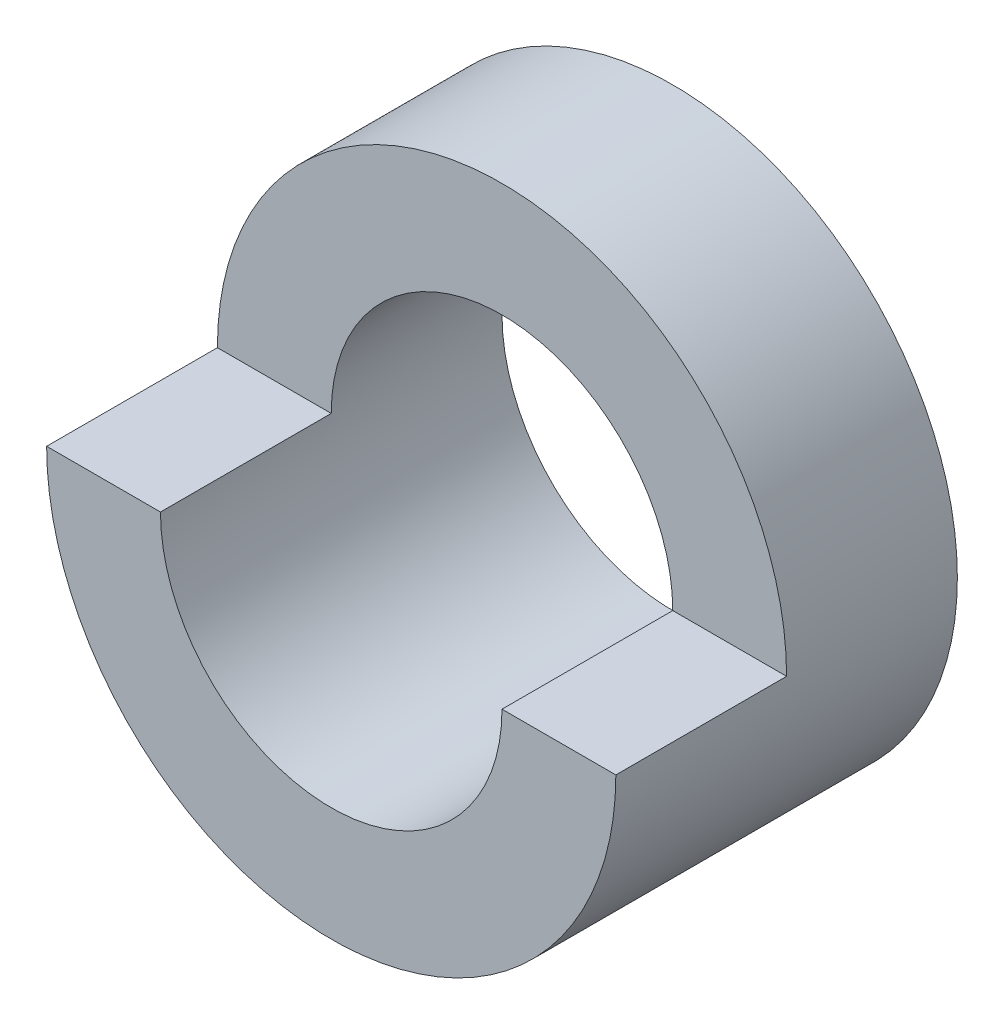
ISO-10303-21;
HEADER;
FILE_DESCRIPTION(('STEP AP214'),'2;1');
FILE_NAME('part.step','',(''),(''),'','','');
FILE_SCHEMA(('AUTOMOTIVE_DESIGN { 1 0 10303 214 1 1 1 1 }'));
ENDSEC;
DATA;
#1=APPLICATION_CONTEXT('core data for automotive mechanical design processes');
#2=APPLICATION_PROTOCOL_DEFINITION('international standard','automotive_design',2000,#1);
#3=PRODUCT_CONTEXT('',#1,'mechanical');
#4=PRODUCT('Part','Part','',(#3));
#5=PRODUCT_RELATED_PRODUCT_CATEGORY('part','',(#4));
#6=PRODUCT_DEFINITION_FORMATION('','',#4);
#7=PRODUCT_DEFINITION_CONTEXT('part definition',#1,'design');
#8=PRODUCT_DEFINITION('design','',#6,#7);
#9=PRODUCT_DEFINITION_SHAPE('','',#8);
#10=(LENGTH_UNIT() NAMED_UNIT(*) SI_UNIT(.MILLI.,.METRE.));
#11=(NAMED_UNIT(*) PLANE_ANGLE_UNIT() SI_UNIT($,.RADIAN.));
#12=(NAMED_UNIT(*) SI_UNIT($,.STERADIAN.) SOLID_ANGLE_UNIT());
#13=UNCERTAINTY_MEASURE_WITH_UNIT(LENGTH_MEASURE(1.E-05),#10,'distance_accuracy_value','');
#14=(GEOMETRIC_REPRESENTATION_CONTEXT(3) GLOBAL_UNCERTAINTY_ASSIGNED_CONTEXT((#13)) GLOBAL_UNIT_ASSIGNED_CONTEXT((#10,
#11,#12)) REPRESENTATION_CONTEXT('',''));
#15=CARTESIAN_POINT('',(0.,0.,0.));
#16=DIRECTION('',(0.,0.,1.));
#17=DIRECTION('',(1.,0.,0.));
#18=AXIS2_PLACEMENT_3D('',#15,#16,#17);
#19=CARTESIAN_POINT('',(0.,0.,60.));
#20=DIRECTION('',(0.,0.,-1.));
#21=DIRECTION('',(-1.,0.,0.));
#22=AXIS2_PLACEMENT_3D('',#19,#20,#21);
#23=CYLINDRICAL_SURFACE('',#22,50.);
#24=CARTESIAN_POINT('',(0.,0.,60.));
#25=DIRECTION('',(0.,0.,1.));
#26=DIRECTION('',(1.,0.,0.));
#27=AXIS2_PLACEMENT_3D('',#24,#25,#26);
#28=CIRCLE('',#27,50.);
#29=CARTESIAN_POINT('',(-50.,0.,60.));
#30=VERTEX_POINT('',#29);
#31=CARTESIAN_POINT('',(50.,0.,60.));
#32=VERTEX_POINT('',#31);
#33=EDGE_CURVE('E11',#30,#32,#28,.T.);
#34=ORIENTED_EDGE('',*,*,#33,.F.);
#35=DIRECTION('',(0.,0.,1.));
#36=VECTOR('',#35,1.);
#37=CARTESIAN_POINT('',(-50.,0.,30.));
#38=LINE('',#37,#36);
#39=CARTESIAN_POINT('',(-50.,0.,30.));
#40=VERTEX_POINT('',#39);
#41=EDGE_CURVE('E93',#40,#30,#38,.T.);
#42=ORIENTED_EDGE('',*,*,#41,.F.);
#43=CARTESIAN_POINT('',(0.,0.,30.));
#44=DIRECTION('',(0.,0.,1.));
#45=DIRECTION('',(1.,0.,0.));
#46=AXIS2_PLACEMENT_3D('',#43,#44,#45);
#47=CIRCLE('',#46,50.);
#48=CARTESIAN_POINT('',(50.,0.,30.));
#49=VERTEX_POINT('',#48);
#50=EDGE_CURVE('E53',#49,#40,#47,.T.);
#51=ORIENTED_EDGE('',*,*,#50,.F.);
#52=DIRECTION('',(0.,0.,1.));
#53=VECTOR('',#52,1.);
#54=CARTESIAN_POINT('',(50.,0.,30.));
#55=LINE('',#54,#53);
#56=EDGE_CURVE('E81',#49,#32,#55,.T.);
#57=ORIENTED_EDGE('',*,*,#56,.T.);
#58=EDGE_LOOP('',(#34,#42,#51,#57));
#59=FACE_BOUND('',#58,.T.);
#60=CARTESIAN_POINT('',(0.,0.,0.));
#61=DIRECTION('',(0.,0.,1.));
#62=DIRECTION('',(1.,0.,0.));
#63=AXIS2_PLACEMENT_3D('',#60,#61,#62);
#64=CIRCLE('',#63,50.);
#65=CARTESIAN_POINT('',(50.,0.,0.));
#66=VERTEX_POINT('',#65);
#67=EDGE_CURVE('E36',#66,#66,#64,.T.);
#68=ORIENTED_EDGE('',*,*,#67,.T.);
#69=EDGE_LOOP('',(#68));
#70=FACE_BOUND('',#69,.T.);
#71=ADVANCED_FACE('F33',(#59,#70),#23,.T.);
#72=CARTESIAN_POINT('',(0.,0.,60.));
#73=DIRECTION('',(0.,0.,1.));
#74=DIRECTION('',(1.,0.,0.));
#75=AXIS2_PLACEMENT_3D('',#72,#73,#74);
#76=PLANE('',#75);
#77=DIRECTION('',(1.,0.,0.));
#78=VECTOR('',#77,1.);
#79=CARTESIAN_POINT('',(-50.,0.,60.));
#80=LINE('',#79,#78);
#81=CARTESIAN_POINT('',(-30.,0.,60.));
#82=VERTEX_POINT('',#81);
#83=EDGE_CURVE('E71',#30,#82,#80,.T.);
#84=ORIENTED_EDGE('',*,*,#83,.F.);
#85=ORIENTED_EDGE('',*,*,#33,.T.);
#86=DIRECTION('',(1.,0.,0.));
#87=VECTOR('',#86,1.);
#88=CARTESIAN_POINT('',(30.,0.,60.));
#89=LINE('',#88,#87);
#90=CARTESIAN_POINT('',(30.,0.,60.));
#91=VERTEX_POINT('',#90);
#92=EDGE_CURVE('E105',#91,#32,#89,.T.);
#93=ORIENTED_EDGE('',*,*,#92,.F.);
#94=CARTESIAN_POINT('',(0.,0.,60.));
#95=DIRECTION('',(0.,0.,1.));
#96=DIRECTION('',(1.,0.,0.));
#97=AXIS2_PLACEMENT_3D('',#94,#95,#96);
#98=CIRCLE('',#97,30.);
#99=EDGE_CURVE('E91',#82,#91,#98,.T.);
#100=ORIENTED_EDGE('',*,*,#99,.F.);
#101=EDGE_LOOP('',(#84,#85,#93,#100));
#102=FACE_BOUND('',#101,.T.);
#103=ADVANCED_FACE('F112',(#102),#76,.T.);
#104=CARTESIAN_POINT('',(0.,0.,0.));
#105=DIRECTION('',(0.,0.,1.));
#106=DIRECTION('',(1.,0.,0.));
#107=AXIS2_PLACEMENT_3D('',#104,#105,#106);
#108=PLANE('',#107);
#109=CARTESIAN_POINT('',(0.,0.,0.));
#110=DIRECTION('',(0.,0.,1.));
#111=DIRECTION('',(1.,0.,0.));
#112=AXIS2_PLACEMENT_3D('',#109,#110,#111);
#113=CIRCLE('',#112,30.);
#114=CARTESIAN_POINT('',(30.,0.,0.));
#115=VERTEX_POINT('',#114);
#116=EDGE_CURVE('E98',#115,#115,#113,.T.);
#117=ORIENTED_EDGE('',*,*,#116,.T.);
#118=EDGE_LOOP('',(#117));
#119=FACE_BOUND('',#118,.T.);
#120=ORIENTED_EDGE('',*,*,#67,.F.);
#121=EDGE_LOOP('',(#120));
#122=FACE_BOUND('',#121,.T.);
#123=ADVANCED_FACE('F114',(#119,#122),#108,.F.);
#124=CARTESIAN_POINT('',(0.,0.,0.));
#125=DIRECTION('',(0.,0.,1.));
#126=DIRECTION('',(1.,0.,0.));
#127=AXIS2_PLACEMENT_3D('',#124,#125,#126);
#128=CYLINDRICAL_SURFACE('',#127,30.);
#129=ORIENTED_EDGE('',*,*,#116,.F.);
#130=EDGE_LOOP('',(#129));
#131=FACE_BOUND('',#130,.T.);
#132=CARTESIAN_POINT('',(0.,0.,30.));
#133=DIRECTION('',(0.,0.,-1.));
#134=DIRECTION('',(1.,0.,0.));
#135=AXIS2_PLACEMENT_3D('',#132,#133,#134);
#136=CIRCLE('',#135,30.);
#137=CARTESIAN_POINT('',(-30.,0.,30.));
#138=VERTEX_POINT('',#137);
#139=CARTESIAN_POINT('',(30.,0.,30.));
#140=VERTEX_POINT('',#139);
#141=EDGE_CURVE('E82',#138,#140,#136,.T.);
#142=ORIENTED_EDGE('',*,*,#141,.F.);
#143=DIRECTION('',(0.,0.,1.));
#144=VECTOR('',#143,1.);
#145=CARTESIAN_POINT('',(-30.,0.,30.));
#146=LINE('',#145,#144);
#147=EDGE_CURVE('E101',#138,#82,#146,.T.);
#148=ORIENTED_EDGE('',*,*,#147,.T.);
#149=ORIENTED_EDGE('',*,*,#99,.T.);
#150=DIRECTION('',(0.,0.,1.));
#151=VECTOR('',#150,1.);
#152=CARTESIAN_POINT('',(30.,0.,30.));
#153=LINE('',#152,#151);
#154=EDGE_CURVE('E78',#140,#91,#153,.T.);
#155=ORIENTED_EDGE('',*,*,#154,.F.);
#156=EDGE_LOOP('',(#142,#148,#149,#155));
#157=FACE_BOUND('',#156,.T.);
#158=ADVANCED_FACE('F89',(#131,#157),#128,.F.);
#159=CARTESIAN_POINT('',(-50.,0.,30.));
#160=DIRECTION('',(0.,-1.,0.));
#161=DIRECTION('',(0.,0.,-1.));
#162=AXIS2_PLACEMENT_3D('',#159,#160,#161);
#163=PLANE('',#162);
#164=ORIENTED_EDGE('',*,*,#83,.T.);
#165=ORIENTED_EDGE('',*,*,#147,.F.);
#166=DIRECTION('',(1.,0.,0.));
#167=VECTOR('',#166,1.);
#168=CARTESIAN_POINT('',(-50.,0.,30.));
#169=LINE('',#168,#167);
#170=EDGE_CURVE('E47',#40,#138,#169,.T.);
#171=ORIENTED_EDGE('',*,*,#170,.F.);
#172=ORIENTED_EDGE('',*,*,#41,.T.);
#173=EDGE_LOOP('',(#164,#165,#171,#172));
#174=FACE_BOUND('',#173,.T.);
#175=ADVANCED_FACE('F124',(#174),#163,.F.);
#176=CARTESIAN_POINT('',(30.,0.,30.));
#177=DIRECTION('',(0.,-1.,0.));
#178=DIRECTION('',(0.,0.,-1.));
#179=AXIS2_PLACEMENT_3D('',#176,#177,#178);
#180=PLANE('',#179);
#181=ORIENTED_EDGE('',*,*,#92,.T.);
#182=ORIENTED_EDGE('',*,*,#56,.F.);
#183=DIRECTION('',(1.,0.,0.));
#184=VECTOR('',#183,1.);
#185=CARTESIAN_POINT('',(30.,0.,30.));
#186=LINE('',#185,#184);
#187=EDGE_CURVE('E75',#140,#49,#186,.T.);
#188=ORIENTED_EDGE('',*,*,#187,.F.);
#189=ORIENTED_EDGE('',*,*,#154,.T.);
#190=EDGE_LOOP('',(#181,#182,#188,#189));
#191=FACE_BOUND('',#190,.T.);
#192=ADVANCED_FACE('F76',(#191),#180,.F.);
#193=CARTESIAN_POINT('',(0.,0.,30.));
#194=DIRECTION('',(0.,0.,1.));
#195=DIRECTION('',(1.,0.,0.));
#196=AXIS2_PLACEMENT_3D('',#193,#194,#195);
#197=PLANE('',#196);
#198=ORIENTED_EDGE('',*,*,#141,.T.);
#199=ORIENTED_EDGE('',*,*,#187,.T.);
#200=ORIENTED_EDGE('',*,*,#50,.T.);
#201=ORIENTED_EDGE('',*,*,#170,.T.);
#202=EDGE_LOOP('',(#198,#199,#200,#201));
#203=FACE_BOUND('',#202,.T.);
#204=ADVANCED_FACE('F85',(#203),#197,.T.);
#205=CLOSED_SHELL('',(#71,#103,#123,#158,#175,#192,#204));
#206=MANIFOLD_SOLID_BREP('B2',#205);
#207=ADVANCED_BREP_SHAPE_REPRESENTATION('',(#18,#206),#14);
#208=SHAPE_DEFINITION_REPRESENTATION(#9,#207);
ENDSEC;
END-ISO-10303-21;
